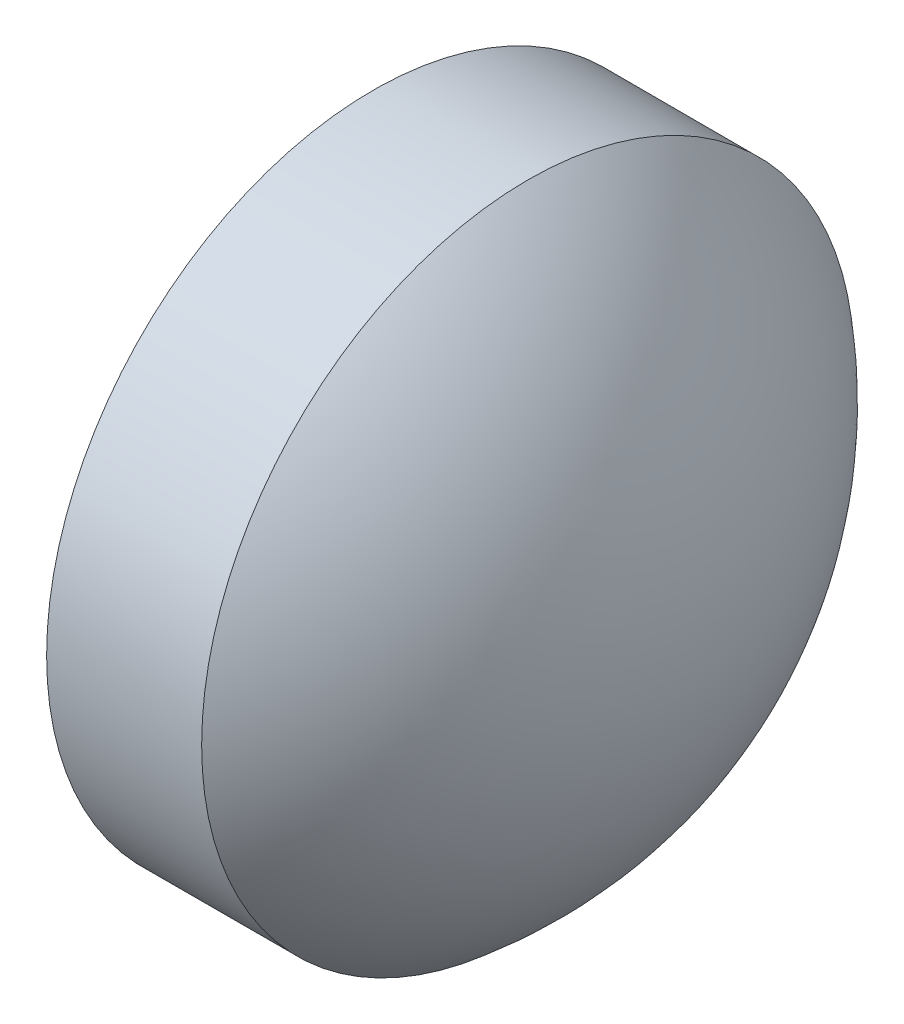
ISO-10303-21;
HEADER;
FILE_DESCRIPTION(('STEP AP214'),'2;1');
FILE_NAME('part.step','',(''),(''),'','','');
FILE_SCHEMA(('AUTOMOTIVE_DESIGN { 1 0 10303 214 1 1 1 1 }'));
ENDSEC;
DATA;
#1=APPLICATION_CONTEXT('core data for automotive mechanical design processes');
#2=APPLICATION_PROTOCOL_DEFINITION('international standard','automotive_design',2000,#1);
#3=PRODUCT_CONTEXT('',#1,'mechanical');
#4=PRODUCT('Part','Part','',(#3));
#5=PRODUCT_RELATED_PRODUCT_CATEGORY('part','',(#4));
#6=PRODUCT_DEFINITION_FORMATION('','',#4);
#7=PRODUCT_DEFINITION_CONTEXT('part definition',#1,'design');
#8=PRODUCT_DEFINITION('design','',#6,#7);
#9=PRODUCT_DEFINITION_SHAPE('','',#8);
#10=(LENGTH_UNIT() NAMED_UNIT(*) SI_UNIT(.MILLI.,.METRE.));
#11=(NAMED_UNIT(*) PLANE_ANGLE_UNIT() SI_UNIT($,.RADIAN.));
#12=(NAMED_UNIT(*) SI_UNIT($,.STERADIAN.) SOLID_ANGLE_UNIT());
#13=UNCERTAINTY_MEASURE_WITH_UNIT(LENGTH_MEASURE(1.E-05),#10,'distance_accuracy_value','');
#14=(GEOMETRIC_REPRESENTATION_CONTEXT(3) GLOBAL_UNCERTAINTY_ASSIGNED_CONTEXT((#13)) GLOBAL_UNIT_ASSIGNED_CONTEXT((#10,
#11,#12)) REPRESENTATION_CONTEXT('',''));
#15=CARTESIAN_POINT('',(0.,0.,0.));
#16=DIRECTION('',(0.,0.,1.));
#17=DIRECTION('',(1.,0.,0.));
#18=AXIS2_PLACEMENT_3D('',#15,#16,#17);
#19=CARTESIAN_POINT('',(386.435692110192,29.3681337965623,0.));
#20=DIRECTION('',(-1.,0.,0.));
#21=DIRECTION('',(0.,1.,0.));
#22=AXIS2_PLACEMENT_3D('',#19,#20,#21);
#23=SPHERICAL_SURFACE('',#22,2.58026315789473);
#24=CARTESIAN_POINT('',(388.065955268086,29.3681337965623,0.));
#25=DIRECTION('',(-1.,0.,0.));
#26=DIRECTION('',(0.,0.,1.));
#27=AXIS2_PLACEMENT_3D('',#24,#25,#26);
#28=CIRCLE('',#27,2.);
#29=CARTESIAN_POINT('',(388.065955268086,29.3681337965623,2.));
#30=VERTEX_POINT('',#29);
#31=EDGE_CURVE('E10',#30,#30,#28,.T.);
#32=ORIENTED_EDGE('',*,*,#31,.F.);
#33=EDGE_LOOP('',(#32));
#34=FACE_BOUND('',#33,.T.);
#35=ADVANCED_FACE('F33',(#34),#23,.T.);
#36=CARTESIAN_POINT('',(386.768704709091,29.3681337965623,0.));
#37=DIRECTION('',(-1.,0.,0.));
#38=DIRECTION('',(0.,0.,1.));
#39=AXIS2_PLACEMENT_3D('',#36,#37,#38);
#40=CYLINDRICAL_SURFACE('',#39,2.);
#41=CARTESIAN_POINT('',(387.115955268086,29.3681337965623,0.));
#42=DIRECTION('',(-1.,0.,0.));
#43=DIRECTION('',(0.,0.,1.));
#44=AXIS2_PLACEMENT_3D('',#41,#42,#43);
#45=CIRCLE('',#44,2.);
#46=CARTESIAN_POINT('',(387.115955268086,29.3681337965623,2.));
#47=VERTEX_POINT('',#46);
#48=EDGE_CURVE('E39',#47,#47,#45,.T.);
#49=ORIENTED_EDGE('',*,*,#48,.F.);
#50=EDGE_LOOP('',(#49));
#51=FACE_BOUND('',#50,.T.);
#52=ORIENTED_EDGE('',*,*,#31,.T.);
#53=EDGE_LOOP('',(#52));
#54=FACE_BOUND('',#53,.T.);
#55=ADVANCED_FACE('F47',(#51,#54),#40,.T.);
#56=CARTESIAN_POINT('',(387.115955268086,29.3681337965623,0.));
#57=DIRECTION('',(1.,0.,0.));
#58=DIRECTION('',(0.,0.,-1.));
#59=AXIS2_PLACEMENT_3D('',#56,#57,#58);
#60=PLANE('',#59);
#61=ORIENTED_EDGE('',*,*,#48,.T.);
#62=EDGE_LOOP('',(#61));
#63=FACE_BOUND('',#62,.T.);
#64=ADVANCED_FACE('F45',(#63),#60,.F.);
#65=CLOSED_SHELL('',(#35,#55,#64));
#66=MANIFOLD_SOLID_BREP('B2',#65);
#67=ADVANCED_BREP_SHAPE_REPRESENTATION('',(#18,#66),#14);
#68=SHAPE_DEFINITION_REPRESENTATION(#9,#67);
ENDSEC;
END-ISO-10303-21;
